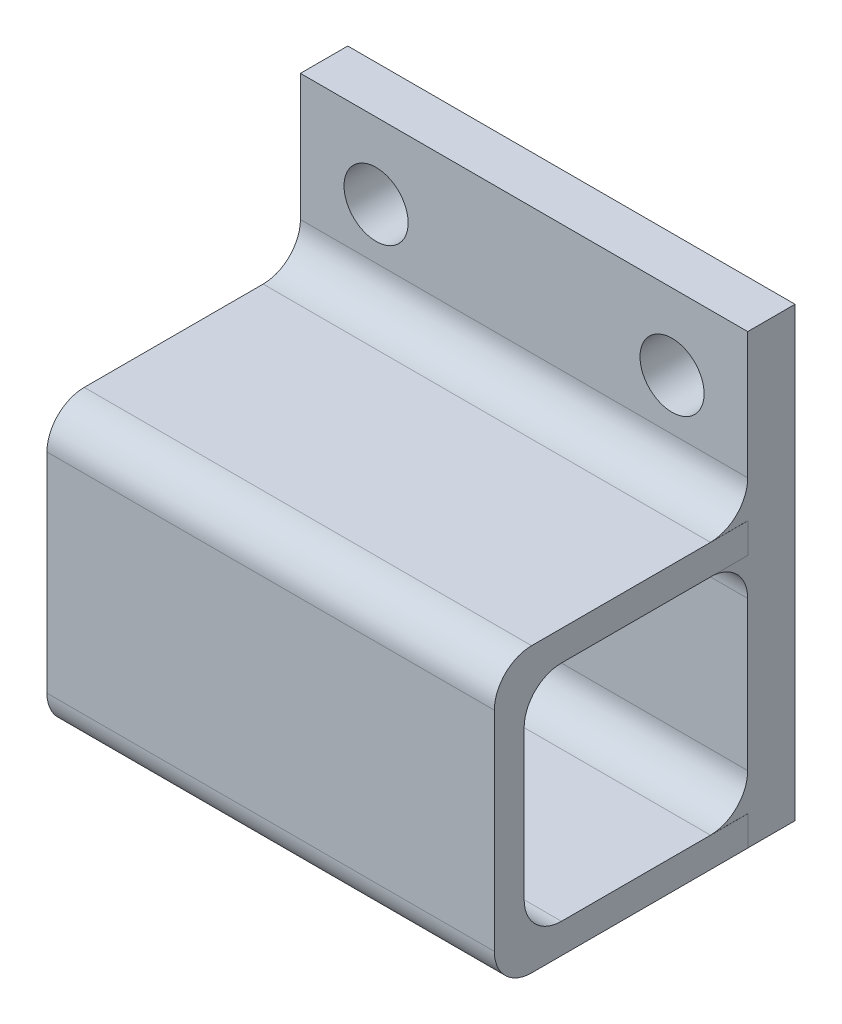
ISO-10303-21;
HEADER;
FILE_DESCRIPTION(('STEP AP214'),'2;1');
FILE_NAME('part.step','',(''),(''),'','','');
FILE_SCHEMA(('AUTOMOTIVE_DESIGN { 1 0 10303 214 1 1 1 1 }'));
ENDSEC;
DATA;
#1=APPLICATION_CONTEXT('core data for automotive mechanical design processes');
#2=APPLICATION_PROTOCOL_DEFINITION('international standard','automotive_design',2000,#1);
#3=PRODUCT_CONTEXT('',#1,'mechanical');
#4=PRODUCT('Part','Part','',(#3));
#5=PRODUCT_RELATED_PRODUCT_CATEGORY('part','',(#4));
#6=PRODUCT_DEFINITION_FORMATION('','',#4);
#7=PRODUCT_DEFINITION_CONTEXT('part definition',#1,'design');
#8=PRODUCT_DEFINITION('design','',#6,#7);
#9=PRODUCT_DEFINITION_SHAPE('','',#8);
#10=(LENGTH_UNIT() NAMED_UNIT(*) SI_UNIT(.MILLI.,.METRE.));
#11=(NAMED_UNIT(*) PLANE_ANGLE_UNIT() SI_UNIT($,.RADIAN.));
#12=(NAMED_UNIT(*) SI_UNIT($,.STERADIAN.) SOLID_ANGLE_UNIT());
#13=UNCERTAINTY_MEASURE_WITH_UNIT(LENGTH_MEASURE(1.E-05),#10,'distance_accuracy_value','');
#14=(GEOMETRIC_REPRESENTATION_CONTEXT(3) GLOBAL_UNCERTAINTY_ASSIGNED_CONTEXT((#13)) GLOBAL_UNIT_ASSIGNED_CONTEXT((#10,
#11,#12)) REPRESENTATION_CONTEXT('',''));
#15=CARTESIAN_POINT('',(0.,0.,0.));
#16=DIRECTION('',(0.,0.,1.));
#17=DIRECTION('',(1.,0.,0.));
#18=AXIS2_PLACEMENT_3D('',#15,#16,#17);
#19=CARTESIAN_POINT('',(0.,0.,3.175));
#20=DIRECTION('',(0.,0.,1.));
#21=DIRECTION('',(1.,0.,0.));
#22=AXIS2_PLACEMENT_3D('',#19,#20,#21);
#23=PLANE('',#22);
#24=DIRECTION('',(0.,1.,0.));
#25=VECTOR('',#24,1.);
#26=CARTESIAN_POINT('',(15.0056664144933,-15.,3.175));
#27=LINE('',#26,#25);
#28=CARTESIAN_POINT('',(15.0056664144933,2.00000000000001,3.175));
#29=VERTEX_POINT('',#28);
#30=CARTESIAN_POINT('',(15.0056664144933,4.00904916701706,3.175));
#31=VERTEX_POINT('',#30);
#32=EDGE_CURVE('E207',#29,#31,#27,.T.);
#33=ORIENTED_EDGE('',*,*,#32,.F.);
#34=DIRECTION('',(-1.,0.,0.));
#35=VECTOR('',#34,1.);
#36=CARTESIAN_POINT('',(15.0056664144933,2.00000000000001,3.175));
#37=LINE('',#36,#35);
#38=CARTESIAN_POINT('',(15.,2.00000000000001,3.175));
#39=VERTEX_POINT('',#38);
#40=EDGE_CURVE('E198',#29,#39,#37,.T.);
#41=ORIENTED_EDGE('',*,*,#40,.T.);
#42=DIRECTION('',(0.,1.,0.));
#43=VECTOR('',#42,1.);
#44=CARTESIAN_POINT('',(15.,-15.,3.175));
#45=LINE('',#44,#43);
#46=CARTESIAN_POINT('',(15.,4.00904916701706,3.175));
#47=VERTEX_POINT('',#46);
#48=EDGE_CURVE('E241',#39,#47,#45,.T.);
#49=ORIENTED_EDGE('',*,*,#48,.T.);
#50=DIRECTION('',(-1.,0.,0.));
#51=VECTOR('',#50,1.);
#52=CARTESIAN_POINT('',(15.0056664144933,4.00904916701706,3.175));
#53=LINE('',#52,#51);
#54=EDGE_CURVE('E206',#31,#47,#53,.T.);
#55=ORIENTED_EDGE('',*,*,#54,.F.);
#56=EDGE_LOOP('',(#33,#41,#49,#55));
#57=FACE_BOUND('',#56,.T.);
#58=ADVANCED_FACE('F36',(#57),#23,.F.);
#59=CARTESIAN_POINT('',(0.,0.,3.175));
#60=DIRECTION('',(0.,0.,1.));
#61=DIRECTION('',(1.,0.,0.));
#62=AXIS2_PLACEMENT_3D('',#59,#60,#61);
#63=PLANE('',#62);
#64=DIRECTION('',(0.,-1.,0.));
#65=VECTOR('',#64,1.);
#66=CARTESIAN_POINT('',(-15.,-15.,3.175));
#67=LINE('',#66,#65);
#68=CARTESIAN_POINT('',(-15.,15.,3.175));
#69=VERTEX_POINT('',#68);
#70=CARTESIAN_POINT('',(-15.,6.50904916701706,3.175));
#71=VERTEX_POINT('',#70);
#72=EDGE_CURVE('E234',#69,#71,#67,.T.);
#73=ORIENTED_EDGE('',*,*,#72,.T.);
#74=DIRECTION('',(-1.,0.,0.));
#75=VECTOR('',#74,1.);
#76=CARTESIAN_POINT('',(0.,6.50904916701706,3.175));
#77=LINE('',#76,#75);
#78=CARTESIAN_POINT('',(15.,6.50904916701706,3.175));
#79=VERTEX_POINT('',#78);
#80=EDGE_CURVE('E306',#71,#79,#77,.F.);
#81=ORIENTED_EDGE('',*,*,#80,.T.);
#82=CARTESIAN_POINT('',(15.,15.,3.175));
#83=VERTEX_POINT('',#82);
#84=EDGE_CURVE('E237',#79,#83,#45,.T.);
#85=ORIENTED_EDGE('',*,*,#84,.T.);
#86=DIRECTION('',(-1.,0.,0.));
#87=VECTOR('',#86,1.);
#88=CARTESIAN_POINT('',(15.,15.,3.175));
#89=LINE('',#88,#87);
#90=EDGE_CURVE('E240',#83,#69,#89,.T.);
#91=ORIENTED_EDGE('',*,*,#90,.T.);
#92=EDGE_LOOP('',(#73,#81,#85,#91));
#93=FACE_BOUND('',#92,.T.);
#94=CARTESIAN_POINT('',(-9.92491166077738,9.92491166077739,3.175));
#95=DIRECTION('',(0.,0.,1.));
#96=DIRECTION('',(1.,0.,0.));
#97=AXIS2_PLACEMENT_3D('',#94,#95,#96);
#98=CIRCLE('',#97,2.15);
#99=CARTESIAN_POINT('',(-7.77491166077738,9.92491166077739,3.175));
#100=VERTEX_POINT('',#99);
#101=EDGE_CURVE('E228',#100,#100,#98,.T.);
#102=ORIENTED_EDGE('',*,*,#101,.F.);
#103=EDGE_LOOP('',(#102));
#104=FACE_BOUND('',#103,.T.);
#105=CARTESIAN_POINT('',(9.92491166077738,9.92491166077739,3.175));
#106=DIRECTION('',(0.,0.,1.));
#107=DIRECTION('',(1.,0.,0.));
#108=AXIS2_PLACEMENT_3D('',#105,#106,#107);
#109=CIRCLE('',#108,2.15);
#110=CARTESIAN_POINT('',(12.0749116607774,9.92491166077739,3.175));
#111=VERTEX_POINT('',#110);
#112=EDGE_CURVE('E222',#111,#111,#109,.T.);
#113=ORIENTED_EDGE('',*,*,#112,.F.);
#114=EDGE_LOOP('',(#113));
#115=FACE_BOUND('',#114,.T.);
#116=ADVANCED_FACE('F332',(#93,#104,#115),#63,.T.);
#117=CARTESIAN_POINT('',(0.,0.,0.));
#118=DIRECTION('',(0.,0.,1.));
#119=DIRECTION('',(1.,0.,0.));
#120=AXIS2_PLACEMENT_3D('',#117,#118,#119);
#121=PLANE('',#120);
#122=DIRECTION('',(0.,-1.,0.));
#123=VECTOR('',#122,1.);
#124=CARTESIAN_POINT('',(-15.,-15.,0.));
#125=LINE('',#124,#123);
#126=CARTESIAN_POINT('',(-15.,15.,0.));
#127=VERTEX_POINT('',#126);
#128=CARTESIAN_POINT('',(-15.,-15.,0.));
#129=VERTEX_POINT('',#128);
#130=EDGE_CURVE('E231',#127,#129,#125,.T.);
#131=ORIENTED_EDGE('',*,*,#130,.F.);
#132=DIRECTION('',(-1.,0.,0.));
#133=VECTOR('',#132,1.);
#134=CARTESIAN_POINT('',(15.,15.,0.));
#135=LINE('',#134,#133);
#136=CARTESIAN_POINT('',(15.,15.,0.));
#137=VERTEX_POINT('',#136);
#138=EDGE_CURVE('E238',#137,#127,#135,.T.);
#139=ORIENTED_EDGE('',*,*,#138,.F.);
#140=DIRECTION('',(0.,1.,0.));
#141=VECTOR('',#140,1.);
#142=CARTESIAN_POINT('',(15.,-15.,0.));
#143=LINE('',#142,#141);
#144=CARTESIAN_POINT('',(15.,-15.,0.));
#145=VERTEX_POINT('',#144);
#146=EDGE_CURVE('E248',#145,#137,#143,.T.);
#147=ORIENTED_EDGE('',*,*,#146,.F.);
#148=DIRECTION('',(1.,0.,0.));
#149=VECTOR('',#148,1.);
#150=CARTESIAN_POINT('',(15.,-15.,0.));
#151=LINE('',#150,#149);
#152=EDGE_CURVE('E246',#129,#145,#151,.T.);
#153=ORIENTED_EDGE('',*,*,#152,.F.);
#154=EDGE_LOOP('',(#131,#139,#147,#153));
#155=FACE_BOUND('',#154,.T.);
#156=CARTESIAN_POINT('',(-9.92491166077738,9.92491166077739,0.));
#157=DIRECTION('',(0.,0.,1.));
#158=DIRECTION('',(1.,0.,0.));
#159=AXIS2_PLACEMENT_3D('',#156,#157,#158);
#160=CIRCLE('',#159,2.15);
#161=CARTESIAN_POINT('',(-7.77491166077738,9.92491166077739,0.));
#162=VERTEX_POINT('',#161);
#163=EDGE_CURVE('E225',#162,#162,#160,.T.);
#164=ORIENTED_EDGE('',*,*,#163,.T.);
#165=EDGE_LOOP('',(#164));
#166=FACE_BOUND('',#165,.T.);
#167=CARTESIAN_POINT('',(9.92491166077738,9.92491166077739,0.));
#168=DIRECTION('',(0.,0.,1.));
#169=DIRECTION('',(1.,0.,0.));
#170=AXIS2_PLACEMENT_3D('',#167,#168,#169);
#171=CIRCLE('',#170,2.15);
#172=CARTESIAN_POINT('',(12.0749116607774,9.92491166077739,0.));
#173=VERTEX_POINT('',#172);
#174=EDGE_CURVE('E221',#173,#173,#171,.T.);
#175=ORIENTED_EDGE('',*,*,#174,.T.);
#176=EDGE_LOOP('',(#175));
#177=FACE_BOUND('',#176,.T.);
#178=ADVANCED_FACE('F356',(#155,#166,#177),#121,.F.);
#179=CARTESIAN_POINT('',(-15.,-15.,3.175));
#180=DIRECTION('',(1.,0.,0.));
#181=DIRECTION('',(0.,1.,0.));
#182=AXIS2_PLACEMENT_3D('',#179,#180,#181);
#183=PLANE('',#182);
#184=DIRECTION('',(0.,0.,1.));
#185=VECTOR('',#184,1.);
#186=CARTESIAN_POINT('',(-15.,-13.,3.175));
#187=LINE('',#186,#185);
#188=CARTESIAN_POINT('',(-15.,-13.,5.675));
#189=VERTEX_POINT('',#188);
#190=CARTESIAN_POINT('',(-15.,-13.,15.675));
#191=VERTEX_POINT('',#190);
#192=EDGE_CURVE('E377',#189,#191,#187,.T.);
#193=ORIENTED_EDGE('',*,*,#192,.F.);
#194=CARTESIAN_POINT('',(-15.,-10.5,5.675));
#195=DIRECTION('',(1.,0.,0.));
#196=DIRECTION('',(0.,1.,0.));
#197=AXIS2_PLACEMENT_3D('',#194,#195,#196);
#198=CIRCLE('',#197,2.5);
#199=CARTESIAN_POINT('',(-15.,-10.5,3.175));
#200=VERTEX_POINT('',#199);
#201=EDGE_CURVE('E320',#189,#200,#198,.T.);
#202=ORIENTED_EDGE('',*,*,#201,.T.);
#203=DIRECTION('',(0.,-1.,0.));
#204=VECTOR('',#203,1.);
#205=CARTESIAN_POINT('',(-15.,2.,3.175));
#206=LINE('',#205,#204);
#207=CARTESIAN_POINT('',(-15.,-0.499999999999996,3.175));
#208=VERTEX_POINT('',#207);
#209=EDGE_CURVE('E379',#208,#200,#206,.T.);
#210=ORIENTED_EDGE('',*,*,#209,.F.);
#211=CARTESIAN_POINT('',(-15.,-0.499999999999996,5.675));
#212=DIRECTION('',(1.,0.,0.));
#213=DIRECTION('',(0.,1.,0.));
#214=AXIS2_PLACEMENT_3D('',#211,#212,#213);
#215=CIRCLE('',#214,2.5);
#216=CARTESIAN_POINT('',(-15.,2.,5.675));
#217=VERTEX_POINT('',#216);
#218=EDGE_CURVE('E312',#208,#217,#215,.T.);
#219=ORIENTED_EDGE('',*,*,#218,.T.);
#220=DIRECTION('',(0.,0.,-1.));
#221=VECTOR('',#220,1.);
#222=CARTESIAN_POINT('',(-15.,2.,3.175));
#223=LINE('',#222,#221);
#224=CARTESIAN_POINT('',(-15.,2.,15.675));
#225=VERTEX_POINT('',#224);
#226=EDGE_CURVE('E190',#225,#217,#223,.T.);
#227=ORIENTED_EDGE('',*,*,#226,.F.);
#228=CARTESIAN_POINT('',(-15.,-0.499999999999996,15.675));
#229=DIRECTION('',(1.,0.,0.));
#230=DIRECTION('',(0.,1.,0.));
#231=AXIS2_PLACEMENT_3D('',#228,#229,#230);
#232=CIRCLE('',#231,2.5);
#233=CARTESIAN_POINT('',(-15.,-0.499999999999996,18.175));
#234=VERTEX_POINT('',#233);
#235=EDGE_CURVE('E316',#225,#234,#232,.T.);
#236=ORIENTED_EDGE('',*,*,#235,.T.);
#237=DIRECTION('',(0.,1.,0.));
#238=VECTOR('',#237,1.);
#239=CARTESIAN_POINT('',(-15.,2.,18.175));
#240=LINE('',#239,#238);
#241=CARTESIAN_POINT('',(-15.,-10.5,18.175));
#242=VERTEX_POINT('',#241);
#243=EDGE_CURVE('E374',#242,#234,#240,.T.);
#244=ORIENTED_EDGE('',*,*,#243,.F.);
#245=CARTESIAN_POINT('',(-15.,-10.5,15.675));
#246=DIRECTION('',(1.,0.,0.));
#247=DIRECTION('',(0.,1.,0.));
#248=AXIS2_PLACEMENT_3D('',#245,#246,#247);
#249=CIRCLE('',#248,2.5);
#250=EDGE_CURVE('E308',#242,#191,#249,.T.);
#251=ORIENTED_EDGE('',*,*,#250,.T.);
#252=EDGE_LOOP('',(#193,#202,#210,#219,#227,#236,#244,#251));
#253=FACE_BOUND('',#252,.T.);
#254=DIRECTION('',(0.,0.,-1.));
#255=VECTOR('',#254,1.);
#256=CARTESIAN_POINT('',(-15.,-15.,3.175));
#257=LINE('',#256,#255);
#258=CARTESIAN_POINT('',(-15.,-15.,17.675));
#259=VERTEX_POINT('',#258);
#260=EDGE_CURVE('E259',#259,#129,#257,.T.);
#261=ORIENTED_EDGE('',*,*,#260,.F.);
#262=CARTESIAN_POINT('',(-15.,-12.5,17.675));
#263=DIRECTION('',(1.,0.,0.));
#264=DIRECTION('',(0.,1.,0.));
#265=AXIS2_PLACEMENT_3D('',#262,#263,#264);
#266=CIRCLE('',#265,2.5);
#267=CARTESIAN_POINT('',(-15.,-12.5,20.175));
#268=VERTEX_POINT('',#267);
#269=EDGE_CURVE('E298',#259,#268,#266,.F.);
#270=ORIENTED_EDGE('',*,*,#269,.T.);
#271=DIRECTION('',(0.,-1.,0.));
#272=VECTOR('',#271,1.);
#273=CARTESIAN_POINT('',(-15.,4.00904916701706,20.175));
#274=LINE('',#273,#272);
#275=CARTESIAN_POINT('',(-15.,1.50904916701706,20.175));
#276=VERTEX_POINT('',#275);
#277=EDGE_CURVE('E362',#276,#268,#274,.T.);
#278=ORIENTED_EDGE('',*,*,#277,.F.);
#279=CARTESIAN_POINT('',(-15.,1.50904916701706,17.675));
#280=DIRECTION('',(1.,0.,0.));
#281=DIRECTION('',(0.,1.,0.));
#282=AXIS2_PLACEMENT_3D('',#279,#280,#281);
#283=CIRCLE('',#282,2.5);
#284=CARTESIAN_POINT('',(-15.,4.00904916701706,17.675));
#285=VERTEX_POINT('',#284);
#286=EDGE_CURVE('E296',#276,#285,#283,.F.);
#287=ORIENTED_EDGE('',*,*,#286,.T.);
#288=DIRECTION('',(0.,0.,-1.));
#289=VECTOR('',#288,1.);
#290=CARTESIAN_POINT('',(-15.,4.00904916701706,18.175));
#291=LINE('',#290,#289);
#292=CARTESIAN_POINT('',(-15.,4.00904916701706,5.675));
#293=VERTEX_POINT('',#292);
#294=EDGE_CURVE('E209',#285,#293,#291,.T.);
#295=ORIENTED_EDGE('',*,*,#294,.T.);
#296=CARTESIAN_POINT('',(-15.,6.50904916701706,5.675));
#297=DIRECTION('',(1.,0.,0.));
#298=DIRECTION('',(0.,1.,0.));
#299=AXIS2_PLACEMENT_3D('',#296,#297,#298);
#300=CIRCLE('',#299,2.5);
#301=EDGE_CURVE('E44',#293,#71,#300,.T.);
#302=ORIENTED_EDGE('',*,*,#301,.T.);
#303=ORIENTED_EDGE('',*,*,#72,.F.);
#304=DIRECTION('',(0.,0.,-1.));
#305=VECTOR('',#304,1.);
#306=CARTESIAN_POINT('',(-15.,15.,3.175));
#307=LINE('',#306,#305);
#308=EDGE_CURVE('E243',#69,#127,#307,.T.);
#309=ORIENTED_EDGE('',*,*,#308,.T.);
#310=ORIENTED_EDGE('',*,*,#130,.T.);
#311=EDGE_LOOP('',(#261,#270,#278,#287,#295,#302,#303,#309,#310));
#312=FACE_BOUND('',#311,.T.);
#313=ADVANCED_FACE('F326',(#253,#312),#183,.F.);
#314=CARTESIAN_POINT('',(15.,-15.,3.175));
#315=DIRECTION('',(0.,1.,0.));
#316=DIRECTION('',(-1.,0.,0.));
#317=AXIS2_PLACEMENT_3D('',#314,#315,#316);
#318=PLANE('',#317);
#319=DIRECTION('',(0.,0.,-1.));
#320=VECTOR('',#319,1.);
#321=CARTESIAN_POINT('',(15.0056664144933,-15.,18.175));
#322=LINE('',#321,#320);
#323=CARTESIAN_POINT('',(15.0056664144933,-15.,17.675));
#324=VERTEX_POINT('',#323);
#325=CARTESIAN_POINT('',(15.0056664144933,-15.,3.175));
#326=VERTEX_POINT('',#325);
#327=EDGE_CURVE('E204',#324,#326,#322,.T.);
#328=ORIENTED_EDGE('',*,*,#327,.F.);
#329=DIRECTION('',(1.,0.,0.));
#330=VECTOR('',#329,1.);
#331=CARTESIAN_POINT('',(-15.,-15.,17.675));
#332=LINE('',#331,#330);
#333=EDGE_CURVE('E294',#324,#259,#332,.F.);
#334=ORIENTED_EDGE('',*,*,#333,.T.);
#335=ORIENTED_EDGE('',*,*,#260,.T.);
#336=ORIENTED_EDGE('',*,*,#152,.T.);
#337=DIRECTION('',(0.,0.,-1.));
#338=VECTOR('',#337,1.);
#339=CARTESIAN_POINT('',(15.,-15.,3.175));
#340=LINE('',#339,#338);
#341=CARTESIAN_POINT('',(15.,-15.,3.175));
#342=VERTEX_POINT('',#341);
#343=EDGE_CURVE('E256',#342,#145,#340,.T.);
#344=ORIENTED_EDGE('',*,*,#343,.F.);
#345=DIRECTION('',(1.,0.,0.));
#346=VECTOR('',#345,1.);
#347=CARTESIAN_POINT('',(15.0056664144933,-15.,3.175));
#348=LINE('',#347,#346);
#349=EDGE_CURVE('E212',#342,#326,#348,.T.);
#350=ORIENTED_EDGE('',*,*,#349,.T.);
#351=EDGE_LOOP('',(#328,#334,#335,#336,#344,#350));
#352=FACE_BOUND('',#351,.T.);
#353=ADVANCED_FACE('F359',(#352),#318,.F.);
#354=CARTESIAN_POINT('',(15.,-15.,3.175));
#355=DIRECTION('',(-1.,0.,0.));
#356=DIRECTION('',(0.,0.,1.));
#357=AXIS2_PLACEMENT_3D('',#354,#355,#356);
#358=PLANE('',#357);
#359=ORIENTED_EDGE('',*,*,#146,.T.);
#360=DIRECTION('',(0.,0.,-1.));
#361=VECTOR('',#360,1.);
#362=CARTESIAN_POINT('',(15.,15.,3.175));
#363=LINE('',#362,#361);
#364=EDGE_CURVE('E253',#83,#137,#363,.T.);
#365=ORIENTED_EDGE('',*,*,#364,.F.);
#366=ORIENTED_EDGE('',*,*,#84,.F.);
#367=CARTESIAN_POINT('',(15.,6.50904916701706,5.675));
#368=DIRECTION('',(-1.,0.,0.));
#369=DIRECTION('',(0.,0.,1.));
#370=AXIS2_PLACEMENT_3D('',#367,#368,#369);
#371=CIRCLE('',#370,2.5);
#372=CARTESIAN_POINT('',(15.,4.00904916701706,5.675));
#373=VERTEX_POINT('',#372);
#374=EDGE_CURVE('E11',#79,#373,#371,.T.);
#375=ORIENTED_EDGE('',*,*,#374,.T.);
#376=DIRECTION('',(0.,0.,1.));
#377=VECTOR('',#376,1.);
#378=CARTESIAN_POINT('',(15.,4.00904916701706,3.175));
#379=LINE('',#378,#377);
#380=EDGE_CURVE('E50',#47,#373,#379,.T.);
#381=ORIENTED_EDGE('',*,*,#380,.F.);
#382=ORIENTED_EDGE('',*,*,#48,.F.);
#383=DIRECTION('',(0.,0.,-1.));
#384=VECTOR('',#383,1.);
#385=CARTESIAN_POINT('',(15.,2.00000000000001,3.175));
#386=LINE('',#385,#384);
#387=CARTESIAN_POINT('',(15.,2.00000000000001,5.675));
#388=VERTEX_POINT('',#387);
#389=EDGE_CURVE('E279',#388,#39,#386,.T.);
#390=ORIENTED_EDGE('',*,*,#389,.F.);
#391=CARTESIAN_POINT('',(15.,-0.499999999999994,5.675));
#392=DIRECTION('',(-1.,0.,0.));
#393=DIRECTION('',(0.,0.,1.));
#394=AXIS2_PLACEMENT_3D('',#391,#392,#393);
#395=CIRCLE('',#394,2.5);
#396=CARTESIAN_POINT('',(15.,-0.499999999999994,3.175));
#397=VERTEX_POINT('',#396);
#398=EDGE_CURVE('E314',#388,#397,#395,.T.);
#399=ORIENTED_EDGE('',*,*,#398,.T.);
#400=DIRECTION('',(0.,-1.,0.));
#401=VECTOR('',#400,1.);
#402=CARTESIAN_POINT('',(15.,-15.,3.175));
#403=LINE('',#402,#401);
#404=CARTESIAN_POINT('',(15.,-10.5,3.175));
#405=VERTEX_POINT('',#404);
#406=EDGE_CURVE('E366',#397,#405,#403,.T.);
#407=ORIENTED_EDGE('',*,*,#406,.T.);
#408=CARTESIAN_POINT('',(15.,-10.5,5.675));
#409=DIRECTION('',(-1.,0.,0.));
#410=DIRECTION('',(0.,0.,1.));
#411=AXIS2_PLACEMENT_3D('',#408,#409,#410);
#412=CIRCLE('',#411,2.5);
#413=CARTESIAN_POINT('',(15.,-13.,5.675));
#414=VERTEX_POINT('',#413);
#415=EDGE_CURVE('E322',#405,#414,#412,.T.);
#416=ORIENTED_EDGE('',*,*,#415,.T.);
#417=DIRECTION('',(0.,0.,1.));
#418=VECTOR('',#417,1.);
#419=CARTESIAN_POINT('',(15.,-13.,3.175));
#420=LINE('',#419,#418);
#421=CARTESIAN_POINT('',(15.,-13.,3.175));
#422=VERTEX_POINT('',#421);
#423=EDGE_CURVE('E57',#422,#414,#420,.T.);
#424=ORIENTED_EDGE('',*,*,#423,.F.);
#425=EDGE_CURVE('E197',#342,#422,#45,.T.);
#426=ORIENTED_EDGE('',*,*,#425,.F.);
#427=ORIENTED_EDGE('',*,*,#343,.T.);
#428=EDGE_LOOP('',(#359,#365,#366,#375,#381,#382,#390,#399,#407,#416,#424,#426,#427));
#429=FACE_BOUND('',#428,.T.);
#430=ADVANCED_FACE('F338',(#429),#358,.F.);
#431=CARTESIAN_POINT('',(15.,15.,3.175));
#432=DIRECTION('',(0.,-1.,0.));
#433=DIRECTION('',(1.,0.,0.));
#434=AXIS2_PLACEMENT_3D('',#431,#432,#433);
#435=PLANE('',#434);
#436=ORIENTED_EDGE('',*,*,#138,.T.);
#437=ORIENTED_EDGE('',*,*,#308,.F.);
#438=ORIENTED_EDGE('',*,*,#90,.F.);
#439=ORIENTED_EDGE('',*,*,#364,.T.);
#440=EDGE_LOOP('',(#436,#437,#438,#439));
#441=FACE_BOUND('',#440,.T.);
#442=ADVANCED_FACE('F352',(#441),#435,.F.);
#443=CARTESIAN_POINT('',(-9.92491166077738,9.92491166077739,3.175));
#444=DIRECTION('',(0.,0.,-1.));
#445=DIRECTION('',(-1.,0.,0.));
#446=AXIS2_PLACEMENT_3D('',#443,#444,#445);
#447=CYLINDRICAL_SURFACE('',#446,2.15);
#448=ORIENTED_EDGE('',*,*,#101,.T.);
#449=EDGE_LOOP('',(#448));
#450=FACE_BOUND('',#449,.T.);
#451=ORIENTED_EDGE('',*,*,#163,.F.);
#452=EDGE_LOOP('',(#451));
#453=FACE_BOUND('',#452,.T.);
#454=ADVANCED_FACE('F438',(#450,#453),#447,.F.);
#455=CARTESIAN_POINT('',(9.92491166077738,9.92491166077739,3.175));
#456=DIRECTION('',(0.,0.,-1.));
#457=DIRECTION('',(-1.,0.,0.));
#458=AXIS2_PLACEMENT_3D('',#455,#456,#457);
#459=CYLINDRICAL_SURFACE('',#458,2.15);
#460=ORIENTED_EDGE('',*,*,#112,.T.);
#461=EDGE_LOOP('',(#460));
#462=FACE_BOUND('',#461,.T.);
#463=ORIENTED_EDGE('',*,*,#174,.F.);
#464=EDGE_LOOP('',(#463));
#465=FACE_BOUND('',#464,.T.);
#466=ADVANCED_FACE('F432',(#462,#465),#459,.F.);
#467=ORIENTED_EDGE('',*,*,#425,.T.);
#468=DIRECTION('',(-1.,0.,0.));
#469=VECTOR('',#468,1.);
#470=CARTESIAN_POINT('',(15.0056664144933,-13.,3.175));
#471=LINE('',#470,#469);
#472=CARTESIAN_POINT('',(15.0056664144933,-13.,3.175));
#473=VERTEX_POINT('',#472);
#474=EDGE_CURVE('E182',#473,#422,#471,.T.);
#475=ORIENTED_EDGE('',*,*,#474,.F.);
#476=EDGE_CURVE('E196',#326,#473,#27,.T.);
#477=ORIENTED_EDGE('',*,*,#476,.F.);
#478=ORIENTED_EDGE('',*,*,#349,.F.);
#479=EDGE_LOOP('',(#467,#475,#477,#478));
#480=FACE_BOUND('',#479,.T.);
#481=ADVANCED_FACE('F194',(#480),#23,.F.);
#482=CARTESIAN_POINT('',(15.0056664144933,-15.,18.175));
#483=DIRECTION('',(-1.,0.,0.));
#484=DIRECTION('',(0.,0.,1.));
#485=AXIS2_PLACEMENT_3D('',#482,#483,#484);
#486=PLANE('',#485);
#487=DIRECTION('',(0.,1.,0.));
#488=VECTOR('',#487,1.);
#489=CARTESIAN_POINT('',(15.0056664144933,4.00904916701706,20.175));
#490=LINE('',#489,#488);
#491=CARTESIAN_POINT('',(15.0056664144933,-12.5,20.175));
#492=VERTEX_POINT('',#491);
#493=CARTESIAN_POINT('',(15.0056664144933,1.50904916701706,20.175));
#494=VERTEX_POINT('',#493);
#495=EDGE_CURVE('E360',#492,#494,#490,.T.);
#496=ORIENTED_EDGE('',*,*,#495,.F.);
#497=CARTESIAN_POINT('',(15.0056664144933,-12.5,17.675));
#498=DIRECTION('',(-1.,0.,0.));
#499=DIRECTION('',(0.,0.,1.));
#500=AXIS2_PLACEMENT_3D('',#497,#498,#499);
#501=CIRCLE('',#500,2.5);
#502=EDGE_CURVE('E292',#492,#324,#501,.F.);
#503=ORIENTED_EDGE('',*,*,#502,.T.);
#504=ORIENTED_EDGE('',*,*,#327,.T.);
#505=ORIENTED_EDGE('',*,*,#476,.T.);
#506=DIRECTION('',(0.,0.,1.));
#507=VECTOR('',#506,1.);
#508=CARTESIAN_POINT('',(15.0056664144933,-13.,3.175));
#509=LINE('',#508,#507);
#510=CARTESIAN_POINT('',(15.0056664144933,-13.,15.675));
#511=VERTEX_POINT('',#510);
#512=EDGE_CURVE('E178',#473,#511,#509,.T.);
#513=ORIENTED_EDGE('',*,*,#512,.T.);
#514=CARTESIAN_POINT('',(15.0056664144933,-10.5,15.675));
#515=DIRECTION('',(-1.,0.,0.));
#516=DIRECTION('',(0.,0.,1.));
#517=AXIS2_PLACEMENT_3D('',#514,#515,#516);
#518=CIRCLE('',#517,2.5);
#519=CARTESIAN_POINT('',(15.0056664144933,-10.5,18.175));
#520=VERTEX_POINT('',#519);
#521=EDGE_CURVE('E310',#511,#520,#518,.T.);
#522=ORIENTED_EDGE('',*,*,#521,.T.);
#523=DIRECTION('',(0.,1.,0.));
#524=VECTOR('',#523,1.);
#525=CARTESIAN_POINT('',(15.0056664144933,2.00000000000001,18.175));
#526=LINE('',#525,#524);
#527=CARTESIAN_POINT('',(15.0056664144933,-0.499999999999994,18.175));
#528=VERTEX_POINT('',#527);
#529=EDGE_CURVE('E189',#520,#528,#526,.T.);
#530=ORIENTED_EDGE('',*,*,#529,.T.);
#531=CARTESIAN_POINT('',(15.0056664144933,-0.499999999999994,15.675));
#532=DIRECTION('',(-1.,0.,0.));
#533=DIRECTION('',(0.,0.,1.));
#534=AXIS2_PLACEMENT_3D('',#531,#532,#533);
#535=CIRCLE('',#534,2.5);
#536=CARTESIAN_POINT('',(15.0056664144933,2.00000000000001,15.675));
#537=VERTEX_POINT('',#536);
#538=EDGE_CURVE('E318',#528,#537,#535,.T.);
#539=ORIENTED_EDGE('',*,*,#538,.T.);
#540=DIRECTION('',(0.,0.,-1.));
#541=VECTOR('',#540,1.);
#542=CARTESIAN_POINT('',(15.0056664144933,2.00000000000001,3.175));
#543=LINE('',#542,#541);
#544=EDGE_CURVE('E199',#537,#29,#543,.T.);
#545=ORIENTED_EDGE('',*,*,#544,.T.);
#546=ORIENTED_EDGE('',*,*,#32,.T.);
#547=DIRECTION('',(0.,0.,-1.));
#548=VECTOR('',#547,1.);
#549=CARTESIAN_POINT('',(15.0056664144933,4.00904916701706,18.175));
#550=LINE('',#549,#548);
#551=CARTESIAN_POINT('',(15.0056664144933,4.00904916701706,17.675));
#552=VERTEX_POINT('',#551);
#553=EDGE_CURVE('E218',#552,#31,#550,.T.);
#554=ORIENTED_EDGE('',*,*,#553,.F.);
#555=CARTESIAN_POINT('',(15.0056664144933,1.50904916701706,17.675));
#556=DIRECTION('',(-1.,0.,0.));
#557=DIRECTION('',(0.,0.,1.));
#558=AXIS2_PLACEMENT_3D('',#555,#556,#557);
#559=CIRCLE('',#558,2.5);
#560=EDGE_CURVE('E290',#552,#494,#559,.F.);
#561=ORIENTED_EDGE('',*,*,#560,.T.);
#562=EDGE_LOOP('',(#496,#503,#504,#505,#513,#522,#530,#539,#545,#546,#554,#561));
#563=FACE_BOUND('',#562,.T.);
#564=ADVANCED_FACE('F202',(#563),#486,.F.);
#565=CARTESIAN_POINT('',(15.0056664144933,4.00904916701706,18.175));
#566=DIRECTION('',(0.,-1.,0.));
#567=DIRECTION('',(1.,0.,0.));
#568=AXIS2_PLACEMENT_3D('',#565,#566,#567);
#569=PLANE('',#568);
#570=ORIENTED_EDGE('',*,*,#294,.F.);
#571=DIRECTION('',(-1.,0.,0.));
#572=VECTOR('',#571,1.);
#573=CARTESIAN_POINT('',(15.0056664144933,4.00904916701706,17.675));
#574=LINE('',#573,#572);
#575=EDGE_CURVE('E304',#285,#552,#574,.F.);
#576=ORIENTED_EDGE('',*,*,#575,.T.);
#577=ORIENTED_EDGE('',*,*,#553,.T.);
#578=ORIENTED_EDGE('',*,*,#54,.T.);
#579=ORIENTED_EDGE('',*,*,#380,.T.);
#580=DIRECTION('',(-1.,0.,0.));
#581=VECTOR('',#580,1.);
#582=CARTESIAN_POINT('',(15.0056664144933,4.00904916701706,5.675));
#583=LINE('',#582,#581);
#584=EDGE_CURVE('E301',#373,#293,#583,.T.);
#585=ORIENTED_EDGE('',*,*,#584,.T.);
#586=EDGE_LOOP('',(#570,#576,#577,#578,#579,#585));
#587=FACE_BOUND('',#586,.T.);
#588=ADVANCED_FACE('F341',(#587),#569,.F.);
#589=CARTESIAN_POINT('',(0.,0.,20.175));
#590=DIRECTION('',(0.,0.,1.));
#591=DIRECTION('',(1.,0.,0.));
#592=AXIS2_PLACEMENT_3D('',#589,#590,#591);
#593=PLANE('',#592);
#594=ORIENTED_EDGE('',*,*,#277,.T.);
#595=DIRECTION('',(1.,0.,0.));
#596=VECTOR('',#595,1.);
#597=CARTESIAN_POINT('',(15.0056664144933,-12.5,20.175));
#598=LINE('',#597,#596);
#599=EDGE_CURVE('E287',#268,#492,#598,.T.);
#600=ORIENTED_EDGE('',*,*,#599,.T.);
#601=ORIENTED_EDGE('',*,*,#495,.T.);
#602=DIRECTION('',(-1.,0.,0.));
#603=VECTOR('',#602,1.);
#604=CARTESIAN_POINT('',(-15.,1.50904916701706,20.175));
#605=LINE('',#604,#603);
#606=EDGE_CURVE('E284',#494,#276,#605,.T.);
#607=ORIENTED_EDGE('',*,*,#606,.T.);
#608=EDGE_LOOP('',(#594,#600,#601,#607));
#609=FACE_BOUND('',#608,.T.);
#610=ADVANCED_FACE('F479',(#609),#593,.T.);
#611=CARTESIAN_POINT('',(15.0056664144933,2.00000000000001,3.175));
#612=DIRECTION('',(0.,1.,0.));
#613=DIRECTION('',(-1.,0.,0.));
#614=AXIS2_PLACEMENT_3D('',#611,#612,#613);
#615=PLANE('',#614);
#616=ORIENTED_EDGE('',*,*,#226,.T.);
#617=DIRECTION('',(-1.,0.,0.));
#618=VECTOR('',#617,1.);
#619=CARTESIAN_POINT('',(15.0056664144933,2.00000000000001,5.675));
#620=LINE('',#619,#618);
#621=EDGE_CURVE('E281',#217,#388,#620,.F.);
#622=ORIENTED_EDGE('',*,*,#621,.T.);
#623=ORIENTED_EDGE('',*,*,#389,.T.);
#624=ORIENTED_EDGE('',*,*,#40,.F.);
#625=ORIENTED_EDGE('',*,*,#544,.F.);
#626=DIRECTION('',(-1.,0.,0.));
#627=VECTOR('',#626,1.);
#628=CARTESIAN_POINT('',(-15.,2.,15.675));
#629=LINE('',#628,#627);
#630=EDGE_CURVE('E276',#537,#225,#629,.T.);
#631=ORIENTED_EDGE('',*,*,#630,.T.);
#632=EDGE_LOOP('',(#616,#622,#623,#624,#625,#631));
#633=FACE_BOUND('',#632,.T.);
#634=ADVANCED_FACE('F395',(#633),#615,.F.);
#635=CARTESIAN_POINT('',(15.0056664144933,-13.,3.175));
#636=DIRECTION('',(0.,-1.,0.));
#637=DIRECTION('',(1.,0.,0.));
#638=AXIS2_PLACEMENT_3D('',#635,#636,#637);
#639=PLANE('',#638);
#640=ORIENTED_EDGE('',*,*,#192,.T.);
#641=DIRECTION('',(-1.,0.,0.));
#642=VECTOR('',#641,1.);
#643=CARTESIAN_POINT('',(15.0056664144933,-13.,15.675));
#644=LINE('',#643,#642);
#645=EDGE_CURVE('E185',#191,#511,#644,.F.);
#646=ORIENTED_EDGE('',*,*,#645,.T.);
#647=ORIENTED_EDGE('',*,*,#512,.F.);
#648=ORIENTED_EDGE('',*,*,#474,.T.);
#649=ORIENTED_EDGE('',*,*,#423,.T.);
#650=DIRECTION('',(-1.,0.,0.));
#651=VECTOR('',#650,1.);
#652=CARTESIAN_POINT('',(15.0056664144933,-13.,5.675));
#653=LINE('',#652,#651);
#654=EDGE_CURVE('E267',#414,#189,#653,.T.);
#655=ORIENTED_EDGE('',*,*,#654,.T.);
#656=EDGE_LOOP('',(#640,#646,#647,#648,#649,#655));
#657=FACE_BOUND('',#656,.T.);
#658=ADVANCED_FACE('F181',(#657),#639,.F.);
#659=ORIENTED_EDGE('',*,*,#406,.F.);
#660=DIRECTION('',(-1.,0.,0.));
#661=VECTOR('',#660,1.);
#662=CARTESIAN_POINT('',(0.,-0.499999999999995,3.175));
#663=LINE('',#662,#661);
#664=EDGE_CURVE('E273',#397,#208,#663,.T.);
#665=ORIENTED_EDGE('',*,*,#664,.T.);
#666=ORIENTED_EDGE('',*,*,#209,.T.);
#667=DIRECTION('',(-1.,0.,0.));
#668=VECTOR('',#667,1.);
#669=CARTESIAN_POINT('',(0.,-10.5,3.175));
#670=LINE('',#669,#668);
#671=EDGE_CURVE('E271',#200,#405,#670,.F.);
#672=ORIENTED_EDGE('',*,*,#671,.T.);
#673=EDGE_LOOP('',(#659,#665,#666,#672));
#674=FACE_BOUND('',#673,.T.);
#675=ADVANCED_FACE('F407',(#674),#63,.T.);
#676=CARTESIAN_POINT('',(0.,0.,18.175));
#677=DIRECTION('',(0.,0.,1.));
#678=DIRECTION('',(1.,0.,0.));
#679=AXIS2_PLACEMENT_3D('',#676,#677,#678);
#680=PLANE('',#679);
#681=ORIENTED_EDGE('',*,*,#529,.F.);
#682=DIRECTION('',(-1.,0.,0.));
#683=VECTOR('',#682,1.);
#684=CARTESIAN_POINT('',(-15.,-10.5,18.175));
#685=LINE('',#684,#683);
#686=EDGE_CURVE('E263',#520,#242,#685,.T.);
#687=ORIENTED_EDGE('',*,*,#686,.T.);
#688=ORIENTED_EDGE('',*,*,#243,.T.);
#689=DIRECTION('',(-1.,0.,0.));
#690=VECTOR('',#689,1.);
#691=CARTESIAN_POINT('',(15.0056664144933,-0.499999999999994,18.175));
#692=LINE('',#691,#690);
#693=EDGE_CURVE('E261',#234,#528,#692,.F.);
#694=ORIENTED_EDGE('',*,*,#693,.T.);
#695=EDGE_LOOP('',(#681,#687,#688,#694));
#696=FACE_BOUND('',#695,.T.);
#697=ADVANCED_FACE('F415',(#696),#680,.F.);
#698=CARTESIAN_POINT('',(0.,-10.5,15.675));
#699=DIRECTION('',(1.,0.,0.));
#700=DIRECTION('',(0.,1.,0.));
#701=AXIS2_PLACEMENT_3D('',#698,#699,#700);
#702=CYLINDRICAL_SURFACE('',#701,2.5);
#703=ORIENTED_EDGE('',*,*,#521,.F.);
#704=ORIENTED_EDGE('',*,*,#645,.F.);
#705=ORIENTED_EDGE('',*,*,#250,.F.);
#706=ORIENTED_EDGE('',*,*,#686,.F.);
#707=EDGE_LOOP('',(#703,#704,#705,#706));
#708=FACE_BOUND('',#707,.T.);
#709=ADVANCED_FACE('F414',(#708),#702,.F.);
#710=CARTESIAN_POINT('',(0.,-0.499999999999995,5.675));
#711=DIRECTION('',(-1.,0.,0.));
#712=DIRECTION('',(0.,-1.,0.));
#713=AXIS2_PLACEMENT_3D('',#710,#711,#712);
#714=CYLINDRICAL_SURFACE('',#713,2.5);
#715=ORIENTED_EDGE('',*,*,#398,.F.);
#716=ORIENTED_EDGE('',*,*,#621,.F.);
#717=ORIENTED_EDGE('',*,*,#218,.F.);
#718=ORIENTED_EDGE('',*,*,#664,.F.);
#719=EDGE_LOOP('',(#715,#716,#717,#718));
#720=FACE_BOUND('',#719,.T.);
#721=ADVANCED_FACE('F404',(#720),#714,.F.);
#722=CARTESIAN_POINT('',(15.0056664144933,-0.499999999999994,15.675));
#723=DIRECTION('',(1.,0.,0.));
#724=DIRECTION('',(0.,1.,0.));
#725=AXIS2_PLACEMENT_3D('',#722,#723,#724);
#726=CYLINDRICAL_SURFACE('',#725,2.5);
#727=ORIENTED_EDGE('',*,*,#538,.F.);
#728=ORIENTED_EDGE('',*,*,#693,.F.);
#729=ORIENTED_EDGE('',*,*,#235,.F.);
#730=ORIENTED_EDGE('',*,*,#630,.F.);
#731=EDGE_LOOP('',(#727,#728,#729,#730));
#732=FACE_BOUND('',#731,.T.);
#733=ADVANCED_FACE('F392',(#732),#726,.F.);
#734=CARTESIAN_POINT('',(15.0056664144933,-10.5,5.675));
#735=DIRECTION('',(-1.,0.,0.));
#736=DIRECTION('',(0.,-1.,0.));
#737=AXIS2_PLACEMENT_3D('',#734,#735,#736);
#738=CYLINDRICAL_SURFACE('',#737,2.5);
#739=ORIENTED_EDGE('',*,*,#415,.F.);
#740=ORIENTED_EDGE('',*,*,#671,.F.);
#741=ORIENTED_EDGE('',*,*,#201,.F.);
#742=ORIENTED_EDGE('',*,*,#654,.F.);
#743=EDGE_LOOP('',(#739,#740,#741,#742));
#744=FACE_BOUND('',#743,.T.);
#745=ADVANCED_FACE('F412',(#744),#738,.F.);
#746=CARTESIAN_POINT('',(0.,-12.5,17.675));
#747=DIRECTION('',(-1.,0.,0.));
#748=DIRECTION('',(0.,-1.,0.));
#749=AXIS2_PLACEMENT_3D('',#746,#747,#748);
#750=CYLINDRICAL_SURFACE('',#749,2.5);
#751=ORIENTED_EDGE('',*,*,#269,.F.);
#752=ORIENTED_EDGE('',*,*,#333,.F.);
#753=ORIENTED_EDGE('',*,*,#502,.F.);
#754=ORIENTED_EDGE('',*,*,#599,.F.);
#755=EDGE_LOOP('',(#751,#752,#753,#754));
#756=FACE_BOUND('',#755,.T.);
#757=ADVANCED_FACE('F464',(#756),#750,.T.);
#758=CARTESIAN_POINT('',(0.,1.50904916701706,17.675));
#759=DIRECTION('',(1.,0.,0.));
#760=DIRECTION('',(0.,1.,0.));
#761=AXIS2_PLACEMENT_3D('',#758,#759,#760);
#762=CYLINDRICAL_SURFACE('',#761,2.5);
#763=ORIENTED_EDGE('',*,*,#560,.F.);
#764=ORIENTED_EDGE('',*,*,#575,.F.);
#765=ORIENTED_EDGE('',*,*,#286,.F.);
#766=ORIENTED_EDGE('',*,*,#606,.F.);
#767=EDGE_LOOP('',(#763,#764,#765,#766));
#768=FACE_BOUND('',#767,.T.);
#769=ADVANCED_FACE('F466',(#768),#762,.T.);
#770=CARTESIAN_POINT('',(15.0056664144933,6.50904916701706,5.675));
#771=DIRECTION('',(-1.,0.,0.));
#772=DIRECTION('',(0.,-1.,0.));
#773=AXIS2_PLACEMENT_3D('',#770,#771,#772);
#774=CYLINDRICAL_SURFACE('',#773,2.5);
#775=ORIENTED_EDGE('',*,*,#374,.F.);
#776=ORIENTED_EDGE('',*,*,#80,.F.);
#777=ORIENTED_EDGE('',*,*,#301,.F.);
#778=ORIENTED_EDGE('',*,*,#584,.F.);
#779=EDGE_LOOP('',(#775,#776,#777,#778));
#780=FACE_BOUND('',#779,.T.);
#781=ADVANCED_FACE('F38',(#780),#774,.F.);
#782=CLOSED_SHELL('',(#58,#116,#178,#313,#353,#430,#442,#454,#466,#481,#564,#588,#610,#634,#658,
#675,#697,#709,#721,#733,#745,#757,#769,#781));
#783=MANIFOLD_SOLID_BREP('B2',#782);
#784=ADVANCED_BREP_SHAPE_REPRESENTATION('',(#18,#783),#14);
#785=SHAPE_DEFINITION_REPRESENTATION(#9,#784);
ENDSEC;
END-ISO-10303-21;
